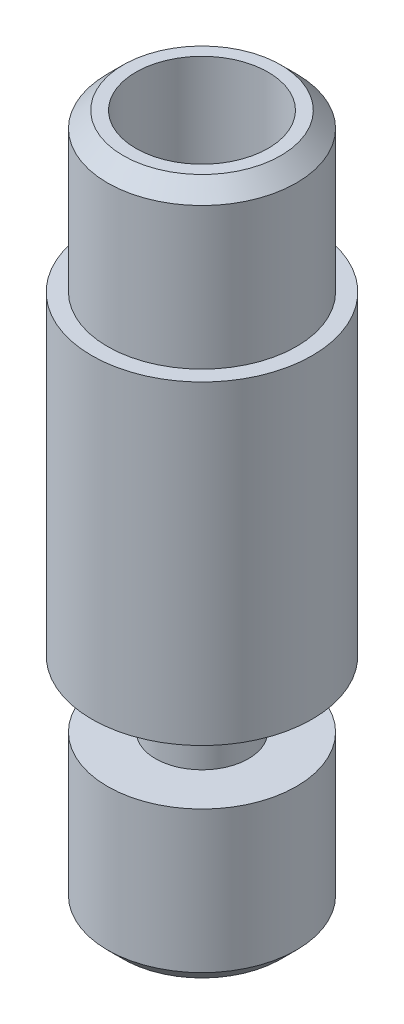
ISO-10303-21;
HEADER;
FILE_DESCRIPTION(('STEP AP214'),'2;1');
FILE_NAME('part.step','',(''),(''),'','','');
FILE_SCHEMA(('AUTOMOTIVE_DESIGN { 1 0 10303 214 1 1 1 1 }'));
ENDSEC;
DATA;
#1=APPLICATION_CONTEXT('core data for automotive mechanical design processes');
#2=APPLICATION_PROTOCOL_DEFINITION('international standard','automotive_design',2000,#1);
#3=PRODUCT_CONTEXT('',#1,'mechanical');
#4=PRODUCT('Part','Part','',(#3));
#5=PRODUCT_RELATED_PRODUCT_CATEGORY('part','',(#4));
#6=PRODUCT_DEFINITION_FORMATION('','',#4);
#7=PRODUCT_DEFINITION_CONTEXT('part definition',#1,'design');
#8=PRODUCT_DEFINITION('design','',#6,#7);
#9=PRODUCT_DEFINITION_SHAPE('','',#8);
#10=(LENGTH_UNIT() NAMED_UNIT(*) SI_UNIT(.MILLI.,.METRE.));
#11=(NAMED_UNIT(*) PLANE_ANGLE_UNIT() SI_UNIT($,.RADIAN.));
#12=(NAMED_UNIT(*) SI_UNIT($,.STERADIAN.) SOLID_ANGLE_UNIT());
#13=UNCERTAINTY_MEASURE_WITH_UNIT(LENGTH_MEASURE(1.E-05),#10,'distance_accuracy_value','');
#14=(GEOMETRIC_REPRESENTATION_CONTEXT(3) GLOBAL_UNCERTAINTY_ASSIGNED_CONTEXT((#13)) GLOBAL_UNIT_ASSIGNED_CONTEXT((#10,
#11,#12)) REPRESENTATION_CONTEXT('',''));
#15=CARTESIAN_POINT('',(0.,0.,0.));
#16=DIRECTION('',(0.,0.,1.));
#17=DIRECTION('',(1.,0.,0.));
#18=AXIS2_PLACEMENT_3D('',#15,#16,#17);
#19=CARTESIAN_POINT('',(0.,-7.1,0.));
#20=DIRECTION('',(0.,-1.,0.));
#21=DIRECTION('',(0.,0.,-1.));
#22=AXIS2_PLACEMENT_3D('',#19,#20,#21);
#23=PLANE('',#22);
#24=CARTESIAN_POINT('',(0.,-7.1,0.));
#25=DIRECTION('',(0.,-1.,0.));
#26=DIRECTION('',(0.,0.,-1.));
#27=AXIS2_PLACEMENT_3D('',#24,#25,#26);
#28=CIRCLE('',#27,2.5);
#29=CARTESIAN_POINT('',(0.,-7.1,-2.5));
#30=VERTEX_POINT('',#29);
#31=EDGE_CURVE('E58',#30,#30,#28,.T.);
#32=ORIENTED_EDGE('',*,*,#31,.T.);
#33=EDGE_LOOP('',(#32));
#34=FACE_BOUND('',#33,.T.);
#35=CARTESIAN_POINT('',(0.,-7.1,0.));
#36=DIRECTION('',(0.,1.,0.));
#37=DIRECTION('',(0.,0.,1.));
#38=AXIS2_PLACEMENT_3D('',#35,#36,#37);
#39=CIRCLE('',#38,1.);
#40=CARTESIAN_POINT('',(0.,-7.1,1.));
#41=VERTEX_POINT('',#40);
#42=EDGE_CURVE('E98',#41,#41,#39,.T.);
#43=ORIENTED_EDGE('',*,*,#42,.T.);
#44=EDGE_LOOP('',(#43));
#45=FACE_BOUND('',#44,.T.);
#46=ADVANCED_FACE('F38',(#34,#45),#23,.T.);
#47=CARTESIAN_POINT('',(0.,0.,0.));
#48=DIRECTION('',(0.,-1.,0.));
#49=DIRECTION('',(0.,0.,-1.));
#50=AXIS2_PLACEMENT_3D('',#47,#48,#49);
#51=CYLINDRICAL_SURFACE('',#50,3.);
#52=CARTESIAN_POINT('',(0.,-6.6,0.));
#53=DIRECTION('',(0.,-1.,0.));
#54=DIRECTION('',(0.,0.,-1.));
#55=AXIS2_PLACEMENT_3D('',#52,#53,#54);
#56=CIRCLE('',#55,3.);
#57=CARTESIAN_POINT('',(0.,-6.6,-3.));
#58=VERTEX_POINT('',#57);
#59=EDGE_CURVE('E52',#58,#58,#56,.F.);
#60=ORIENTED_EDGE('',*,*,#59,.T.);
#61=EDGE_LOOP('',(#60));
#62=FACE_BOUND('',#61,.T.);
#63=CARTESIAN_POINT('',(0.,-2.1,0.));
#64=DIRECTION('',(0.,-1.,0.));
#65=DIRECTION('',(0.,0.,-1.));
#66=AXIS2_PLACEMENT_3D('',#63,#64,#65);
#67=CIRCLE('',#66,3.);
#68=CARTESIAN_POINT('',(0.,-2.1,-3.));
#69=VERTEX_POINT('',#68);
#70=EDGE_CURVE('E64',#69,#69,#67,.T.);
#71=ORIENTED_EDGE('',*,*,#70,.T.);
#72=EDGE_LOOP('',(#71));
#73=FACE_BOUND('',#72,.T.);
#74=ADVANCED_FACE('F119',(#62,#73),#51,.T.);
#75=CARTESIAN_POINT('',(3.,-2.1,0.));
#76=DIRECTION('',(0.,1.,0.));
#77=DIRECTION('',(0.,0.,1.));
#78=AXIS2_PLACEMENT_3D('',#75,#76,#77);
#79=PLANE('',#78);
#80=CARTESIAN_POINT('',(0.,-2.1,0.));
#81=DIRECTION('',(0.,-1.,0.));
#82=DIRECTION('',(0.,0.,-1.));
#83=AXIS2_PLACEMENT_3D('',#80,#81,#82);
#84=CIRCLE('',#83,1.475);
#85=CARTESIAN_POINT('',(0.,-2.1,-1.475));
#86=VERTEX_POINT('',#85);
#87=EDGE_CURVE('E68',#86,#86,#84,.T.);
#88=ORIENTED_EDGE('',*,*,#87,.T.);
#89=EDGE_LOOP('',(#88));
#90=FACE_BOUND('',#89,.T.);
#91=ORIENTED_EDGE('',*,*,#70,.F.);
#92=EDGE_LOOP('',(#91));
#93=FACE_BOUND('',#92,.T.);
#94=ADVANCED_FACE('F125',(#90,#93),#79,.T.);
#95=CARTESIAN_POINT('',(0.,0.,0.));
#96=DIRECTION('',(0.,-1.,0.));
#97=DIRECTION('',(0.,0.,-1.));
#98=AXIS2_PLACEMENT_3D('',#95,#96,#97);
#99=CYLINDRICAL_SURFACE('',#98,1.475);
#100=CARTESIAN_POINT('',(0.,0.,0.));
#101=DIRECTION('',(0.,-1.,0.));
#102=DIRECTION('',(0.,0.,-1.));
#103=AXIS2_PLACEMENT_3D('',#100,#101,#102);
#104=CIRCLE('',#103,1.475);
#105=CARTESIAN_POINT('',(0.,0.,-1.475));
#106=VERTEX_POINT('',#105);
#107=EDGE_CURVE('E72',#106,#106,#104,.T.);
#108=ORIENTED_EDGE('',*,*,#107,.T.);
#109=EDGE_LOOP('',(#108));
#110=FACE_BOUND('',#109,.T.);
#111=ORIENTED_EDGE('',*,*,#87,.F.);
#112=EDGE_LOOP('',(#111));
#113=FACE_BOUND('',#112,.T.);
#114=ADVANCED_FACE('F131',(#110,#113),#99,.T.);
#115=CARTESIAN_POINT('',(1.475,0.,0.));
#116=DIRECTION('',(0.,-1.,0.));
#117=DIRECTION('',(0.,0.,-1.));
#118=AXIS2_PLACEMENT_3D('',#115,#116,#117);
#119=PLANE('',#118);
#120=CARTESIAN_POINT('',(0.,0.,0.));
#121=DIRECTION('',(0.,-1.,0.));
#122=DIRECTION('',(0.,0.,-1.));
#123=AXIS2_PLACEMENT_3D('',#120,#121,#122);
#124=CIRCLE('',#123,3.5);
#125=CARTESIAN_POINT('',(0.,0.,-3.5));
#126=VERTEX_POINT('',#125);
#127=EDGE_CURVE('E76',#126,#126,#124,.T.);
#128=ORIENTED_EDGE('',*,*,#127,.T.);
#129=EDGE_LOOP('',(#128));
#130=FACE_BOUND('',#129,.T.);
#131=ORIENTED_EDGE('',*,*,#107,.F.);
#132=EDGE_LOOP('',(#131));
#133=FACE_BOUND('',#132,.T.);
#134=ADVANCED_FACE('F135',(#130,#133),#119,.T.);
#135=CARTESIAN_POINT('',(0.,0.,0.));
#136=DIRECTION('',(0.,-1.,0.));
#137=DIRECTION('',(0.,0.,-1.));
#138=AXIS2_PLACEMENT_3D('',#135,#136,#137);
#139=CYLINDRICAL_SURFACE('',#138,3.5);
#140=CARTESIAN_POINT('',(0.,10.,0.));
#141=DIRECTION('',(0.,-1.,0.));
#142=DIRECTION('',(0.,0.,-1.));
#143=AXIS2_PLACEMENT_3D('',#140,#141,#142);
#144=CIRCLE('',#143,3.5);
#145=CARTESIAN_POINT('',(0.,10.,-3.5));
#146=VERTEX_POINT('',#145);
#147=EDGE_CURVE('E80',#146,#146,#144,.T.);
#148=ORIENTED_EDGE('',*,*,#147,.T.);
#149=EDGE_LOOP('',(#148));
#150=FACE_BOUND('',#149,.T.);
#151=ORIENTED_EDGE('',*,*,#127,.F.);
#152=EDGE_LOOP('',(#151));
#153=FACE_BOUND('',#152,.T.);
#154=ADVANCED_FACE('F139',(#150,#153),#139,.T.);
#155=CARTESIAN_POINT('',(3.5,10.,0.));
#156=DIRECTION('',(0.,1.,0.));
#157=DIRECTION('',(0.,0.,1.));
#158=AXIS2_PLACEMENT_3D('',#155,#156,#157);
#159=PLANE('',#158);
#160=CARTESIAN_POINT('',(0.,10.,0.));
#161=DIRECTION('',(0.,-1.,0.));
#162=DIRECTION('',(0.,0.,-1.));
#163=AXIS2_PLACEMENT_3D('',#160,#161,#162);
#164=CIRCLE('',#163,3.);
#165=CARTESIAN_POINT('',(0.,10.,-3.));
#166=VERTEX_POINT('',#165);
#167=EDGE_CURVE('E84',#166,#166,#164,.T.);
#168=ORIENTED_EDGE('',*,*,#167,.T.);
#169=EDGE_LOOP('',(#168));
#170=FACE_BOUND('',#169,.T.);
#171=ORIENTED_EDGE('',*,*,#147,.F.);
#172=EDGE_LOOP('',(#171));
#173=FACE_BOUND('',#172,.T.);
#174=ADVANCED_FACE('F143',(#170,#173),#159,.T.);
#175=CARTESIAN_POINT('',(0.,0.,0.));
#176=DIRECTION('',(0.,-1.,0.));
#177=DIRECTION('',(0.,0.,-1.));
#178=AXIS2_PLACEMENT_3D('',#175,#176,#177);
#179=CYLINDRICAL_SURFACE('',#178,3.);
#180=CARTESIAN_POINT('',(0.,14.5,0.));
#181=DIRECTION('',(0.,1.,0.));
#182=DIRECTION('',(0.,0.,1.));
#183=AXIS2_PLACEMENT_3D('',#180,#181,#182);
#184=CIRCLE('',#183,3.);
#185=CARTESIAN_POINT('',(0.,14.5,3.));
#186=VERTEX_POINT('',#185);
#187=EDGE_CURVE('E46',#186,#186,#184,.F.);
#188=ORIENTED_EDGE('',*,*,#187,.T.);
#189=EDGE_LOOP('',(#188));
#190=FACE_BOUND('',#189,.T.);
#191=ORIENTED_EDGE('',*,*,#167,.F.);
#192=EDGE_LOOP('',(#191));
#193=FACE_BOUND('',#192,.T.);
#194=ADVANCED_FACE('F147',(#190,#193),#179,.T.);
#195=CARTESIAN_POINT('',(3.,15.,0.));
#196=DIRECTION('',(0.,1.,0.));
#197=DIRECTION('',(0.,0.,1.));
#198=AXIS2_PLACEMENT_3D('',#195,#196,#197);
#199=PLANE('',#198);
#200=CARTESIAN_POINT('',(0.,15.,0.));
#201=DIRECTION('',(0.,1.,0.));
#202=DIRECTION('',(0.,0.,1.));
#203=AXIS2_PLACEMENT_3D('',#200,#201,#202);
#204=CIRCLE('',#203,2.5);
#205=CARTESIAN_POINT('',(0.,15.,2.5));
#206=VERTEX_POINT('',#205);
#207=EDGE_CURVE('E10',#206,#206,#204,.T.);
#208=ORIENTED_EDGE('',*,*,#207,.T.);
#209=EDGE_LOOP('',(#208));
#210=FACE_BOUND('',#209,.T.);
#211=CARTESIAN_POINT('',(0.,15.,0.));
#212=DIRECTION('',(0.,1.,0.));
#213=DIRECTION('',(0.,0.,1.));
#214=AXIS2_PLACEMENT_3D('',#211,#212,#213);
#215=CIRCLE('',#214,2.1);
#216=CARTESIAN_POINT('',(0.,15.,2.1));
#217=VERTEX_POINT('',#216);
#218=EDGE_CURVE('E88',#217,#217,#215,.T.);
#219=ORIENTED_EDGE('',*,*,#218,.F.);
#220=EDGE_LOOP('',(#219));
#221=FACE_BOUND('',#220,.T.);
#222=ADVANCED_FACE('F151',(#210,#221),#199,.T.);
#223=CARTESIAN_POINT('',(0.,15.,0.));
#224=DIRECTION('',(0.,1.,0.));
#225=DIRECTION('',(0.,0.,1.));
#226=AXIS2_PLACEMENT_3D('',#223,#224,#225);
#227=CYLINDRICAL_SURFACE('',#226,2.1);
#228=ORIENTED_EDGE('',*,*,#218,.T.);
#229=EDGE_LOOP('',(#228));
#230=FACE_BOUND('',#229,.T.);
#231=CARTESIAN_POINT('',(0.,10.,0.));
#232=DIRECTION('',(0.,1.,0.));
#233=DIRECTION('',(0.,0.,1.));
#234=AXIS2_PLACEMENT_3D('',#231,#232,#233);
#235=CIRCLE('',#234,2.1);
#236=CARTESIAN_POINT('',(0.,10.,2.1));
#237=VERTEX_POINT('',#236);
#238=EDGE_CURVE('E91',#237,#237,#235,.T.);
#239=ORIENTED_EDGE('',*,*,#238,.F.);
#240=EDGE_LOOP('',(#239));
#241=FACE_BOUND('',#240,.T.);
#242=ADVANCED_FACE('F115',(#230,#241),#227,.F.);
#243=CARTESIAN_POINT('',(0.,9.33905331906969,0.));
#244=DIRECTION('',(0.,1.,0.));
#245=DIRECTION('',(0.,0.,1.));
#246=AXIS2_PLACEMENT_3D('',#243,#244,#245);
#247=CONICAL_SURFACE('',#246,1.,1.02974425867666);
#248=ORIENTED_EDGE('',*,*,#238,.T.);
#249=EDGE_LOOP('',(#248));
#250=FACE_BOUND('',#249,.T.);
#251=CARTESIAN_POINT('',(0.,9.33905331906969,0.));
#252=DIRECTION('',(0.,1.,0.));
#253=DIRECTION('',(0.,0.,1.));
#254=AXIS2_PLACEMENT_3D('',#251,#252,#253);
#255=CIRCLE('',#254,1.);
#256=CARTESIAN_POINT('',(0.,9.33905331906969,1.));
#257=VERTEX_POINT('',#256);
#258=EDGE_CURVE('E94',#257,#257,#255,.T.);
#259=ORIENTED_EDGE('',*,*,#258,.F.);
#260=EDGE_LOOP('',(#259));
#261=FACE_BOUND('',#260,.T.);
#262=ADVANCED_FACE('F107',(#250,#261),#247,.F.);
#263=CARTESIAN_POINT('',(0.,15.,0.));
#264=DIRECTION('',(0.,1.,0.));
#265=DIRECTION('',(0.,0.,1.));
#266=AXIS2_PLACEMENT_3D('',#263,#264,#265);
#267=CYLINDRICAL_SURFACE('',#266,1.);
#268=ORIENTED_EDGE('',*,*,#258,.T.);
#269=EDGE_LOOP('',(#268));
#270=FACE_BOUND('',#269,.T.);
#271=ORIENTED_EDGE('',*,*,#42,.F.);
#272=EDGE_LOOP('',(#271));
#273=FACE_BOUND('',#272,.T.);
#274=ADVANCED_FACE('F104',(#270,#273),#267,.F.);
#275=CARTESIAN_POINT('',(0.,-7.1,0.));
#276=DIRECTION('',(0.,1.,0.));
#277=DIRECTION('',(0.,0.,1.));
#278=AXIS2_PLACEMENT_3D('',#275,#276,#277);
#279=CONICAL_SURFACE('',#278,2.5,0.785398163397448);
#280=ORIENTED_EDGE('',*,*,#59,.F.);
#281=EDGE_LOOP('',(#280));
#282=FACE_BOUND('',#281,.T.);
#283=ORIENTED_EDGE('',*,*,#31,.F.);
#284=EDGE_LOOP('',(#283));
#285=FACE_BOUND('',#284,.T.);
#286=ADVANCED_FACE('F106',(#282,#285),#279,.T.);
#287=CARTESIAN_POINT('',(0.,14.5,0.));
#288=DIRECTION('',(0.,-1.,0.));
#289=DIRECTION('',(0.,0.,-1.));
#290=AXIS2_PLACEMENT_3D('',#287,#288,#289);
#291=CONICAL_SURFACE('',#290,3.,0.785398163397451);
#292=ORIENTED_EDGE('',*,*,#207,.F.);
#293=EDGE_LOOP('',(#292));
#294=FACE_BOUND('',#293,.T.);
#295=ORIENTED_EDGE('',*,*,#187,.F.);
#296=EDGE_LOOP('',(#295));
#297=FACE_BOUND('',#296,.T.);
#298=ADVANCED_FACE('F40',(#294,#297),#291,.T.);
#299=CLOSED_SHELL('',(#46,#74,#94,#114,#134,#154,#174,#194,#222,#242,#262,#274,#286,#298));
#300=MANIFOLD_SOLID_BREP('B2',#299);
#301=ADVANCED_BREP_SHAPE_REPRESENTATION('',(#18,#300),#14);
#302=SHAPE_DEFINITION_REPRESENTATION(#9,#301);
ENDSEC;
END-ISO-10303-21;
